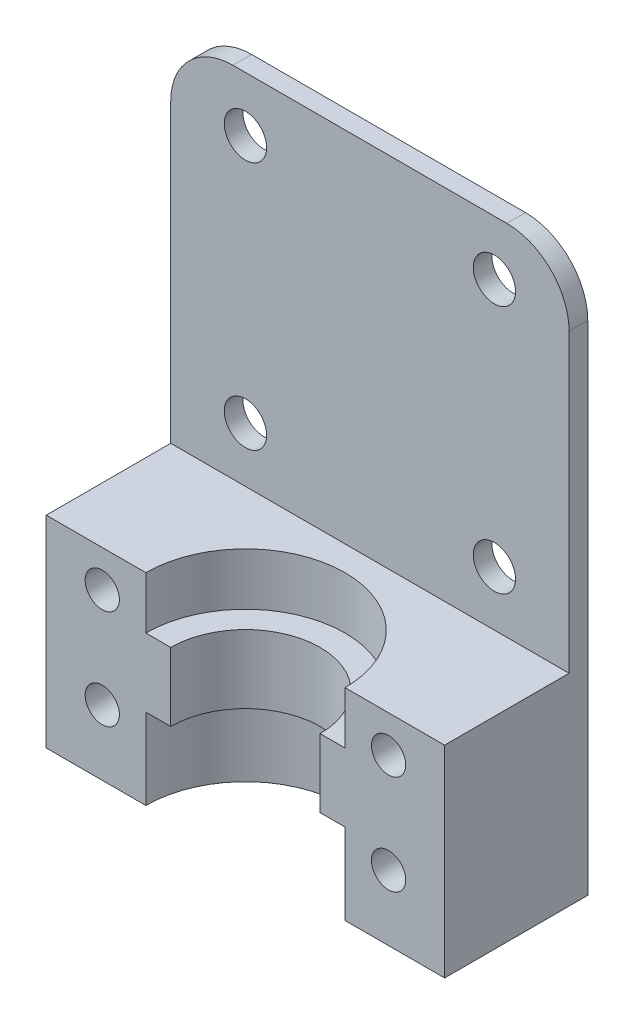
ISO-10303-21;
HEADER;
FILE_DESCRIPTION(('STEP AP214'),'2;1');
FILE_NAME('part.step','',(''),(''),'','','');
FILE_SCHEMA(('AUTOMOTIVE_DESIGN { 1 0 10303 214 1 1 1 1 }'));
ENDSEC;
DATA;
#1=APPLICATION_CONTEXT('core data for automotive mechanical design processes');
#2=APPLICATION_PROTOCOL_DEFINITION('international standard','automotive_design',2000,#1);
#3=PRODUCT_CONTEXT('',#1,'mechanical');
#4=PRODUCT('Part','Part','',(#3));
#5=PRODUCT_RELATED_PRODUCT_CATEGORY('part','',(#4));
#6=PRODUCT_DEFINITION_FORMATION('','',#4);
#7=PRODUCT_DEFINITION_CONTEXT('part definition',#1,'design');
#8=PRODUCT_DEFINITION('design','',#6,#7);
#9=PRODUCT_DEFINITION_SHAPE('','',#8);
#10=(LENGTH_UNIT() NAMED_UNIT(*) SI_UNIT(.MILLI.,.METRE.));
#11=(NAMED_UNIT(*) PLANE_ANGLE_UNIT() SI_UNIT($,.RADIAN.));
#12=(NAMED_UNIT(*) SI_UNIT($,.STERADIAN.) SOLID_ANGLE_UNIT());
#13=UNCERTAINTY_MEASURE_WITH_UNIT(LENGTH_MEASURE(1.E-05),#10,'distance_accuracy_value','');
#14=(GEOMETRIC_REPRESENTATION_CONTEXT(3) GLOBAL_UNCERTAINTY_ASSIGNED_CONTEXT((#13)) GLOBAL_UNIT_ASSIGNED_CONTEXT((#10,
#11,#12)) REPRESENTATION_CONTEXT('',''));
#15=CARTESIAN_POINT('',(0.,0.,0.));
#16=DIRECTION('',(0.,0.,1.));
#17=DIRECTION('',(1.,0.,0.));
#18=AXIS2_PLACEMENT_3D('',#15,#16,#17);
#19=CARTESIAN_POINT('',(16.,0.,-1.5));
#20=DIRECTION('',(0.,0.,1.));
#21=DIRECTION('',(0.,-1.,0.));
#22=AXIS2_PLACEMENT_3D('',#19,#20,#21);
#23=PLANE('',#22);
#24=CARTESIAN_POINT('',(-10.,20.6,-1.5));
#25=DIRECTION('',(0.,0.,1.));
#26=DIRECTION('',(0.,-1.,0.));
#27=AXIS2_PLACEMENT_3D('',#24,#25,#26);
#28=CIRCLE('',#27,1.69999999999999);
#29=CARTESIAN_POINT('',(-10.,18.9,-1.5));
#30=VERTEX_POINT('',#29);
#31=EDGE_CURVE('E474',#30,#30,#28,.T.);
#32=ORIENTED_EDGE('',*,*,#31,.T.);
#33=EDGE_LOOP('',(#32));
#34=FACE_BOUND('',#33,.T.);
#35=CARTESIAN_POINT('',(-10.,40.6,-1.5));
#36=DIRECTION('',(0.,0.,1.));
#37=DIRECTION('',(0.,-1.,0.));
#38=AXIS2_PLACEMENT_3D('',#35,#36,#37);
#39=CIRCLE('',#38,1.69999999999999);
#40=CARTESIAN_POINT('',(-10.,38.9,-1.5));
#41=VERTEX_POINT('',#40);
#42=EDGE_CURVE('E468',#41,#41,#39,.T.);
#43=ORIENTED_EDGE('',*,*,#42,.T.);
#44=EDGE_LOOP('',(#43));
#45=FACE_BOUND('',#44,.T.);
#46=CARTESIAN_POINT('',(10.,40.6,-1.5));
#47=DIRECTION('',(0.,0.,1.));
#48=DIRECTION('',(0.,-1.,0.));
#49=AXIS2_PLACEMENT_3D('',#46,#47,#48);
#50=CIRCLE('',#49,1.69999999999999);
#51=CARTESIAN_POINT('',(10.,38.9,-1.5));
#52=VERTEX_POINT('',#51);
#53=EDGE_CURVE('E462',#52,#52,#50,.T.);
#54=ORIENTED_EDGE('',*,*,#53,.T.);
#55=EDGE_LOOP('',(#54));
#56=FACE_BOUND('',#55,.T.);
#57=CARTESIAN_POINT('',(10.,20.6,-1.5));
#58=DIRECTION('',(0.,0.,1.));
#59=DIRECTION('',(0.,-1.,0.));
#60=AXIS2_PLACEMENT_3D('',#57,#58,#59);
#61=CIRCLE('',#60,1.69999999999999);
#62=CARTESIAN_POINT('',(10.,18.9,-1.5));
#63=VERTEX_POINT('',#62);
#64=EDGE_CURVE('E296',#63,#63,#61,.T.);
#65=ORIENTED_EDGE('',*,*,#64,.T.);
#66=EDGE_LOOP('',(#65));
#67=FACE_BOUND('',#66,.T.);
#68=CARTESIAN_POINT('',(11.5,5.25,-1.5));
#69=DIRECTION('',(0.,0.,1.));
#70=DIRECTION('',(0.,-1.,0.));
#71=AXIS2_PLACEMENT_3D('',#68,#69,#70);
#72=CIRCLE('',#71,1.375);
#73=CARTESIAN_POINT('',(11.5,3.875,-1.5));
#74=VERTEX_POINT('',#73);
#75=EDGE_CURVE('E416',#74,#74,#72,.T.);
#76=ORIENTED_EDGE('',*,*,#75,.T.);
#77=EDGE_LOOP('',(#76));
#78=FACE_BOUND('',#77,.T.);
#79=CARTESIAN_POINT('',(-11.5,5.25,-1.5));
#80=DIRECTION('',(0.,0.,1.));
#81=DIRECTION('',(0.,-1.,0.));
#82=AXIS2_PLACEMENT_3D('',#79,#80,#81);
#83=CIRCLE('',#82,1.375);
#84=CARTESIAN_POINT('',(-11.5,3.87500000000001,-1.5));
#85=VERTEX_POINT('',#84);
#86=EDGE_CURVE('E410',#85,#85,#83,.T.);
#87=ORIENTED_EDGE('',*,*,#86,.T.);
#88=EDGE_LOOP('',(#87));
#89=FACE_BOUND('',#88,.T.);
#90=CARTESIAN_POINT('',(11.5,13.25,-1.5));
#91=DIRECTION('',(0.,0.,1.));
#92=DIRECTION('',(0.,-1.,0.));
#93=AXIS2_PLACEMENT_3D('',#90,#91,#92);
#94=CIRCLE('',#93,1.375);
#95=CARTESIAN_POINT('',(11.5,11.875,-1.5));
#96=VERTEX_POINT('',#95);
#97=EDGE_CURVE('E404',#96,#96,#94,.T.);
#98=ORIENTED_EDGE('',*,*,#97,.T.);
#99=EDGE_LOOP('',(#98));
#100=FACE_BOUND('',#99,.T.);
#101=CARTESIAN_POINT('',(-11.5,13.25,-1.5));
#102=DIRECTION('',(0.,0.,1.));
#103=DIRECTION('',(0.,-1.,0.));
#104=AXIS2_PLACEMENT_3D('',#101,#102,#103);
#105=CIRCLE('',#104,1.375);
#106=CARTESIAN_POINT('',(-11.5,11.875,-1.5));
#107=VERTEX_POINT('',#106);
#108=EDGE_CURVE('E386',#107,#107,#105,.T.);
#109=ORIENTED_EDGE('',*,*,#108,.T.);
#110=EDGE_LOOP('',(#109));
#111=FACE_BOUND('',#110,.T.);
#112=DIRECTION('',(0.,1.,0.));
#113=VECTOR('',#112,1.);
#114=CARTESIAN_POINT('',(-16.,0.,-1.5));
#115=LINE('',#114,#113);
#116=CARTESIAN_POINT('',(-16.,0.,-1.5));
#117=VERTEX_POINT('',#116);
#118=CARTESIAN_POINT('',(-16.,40.,-1.5));
#119=VERTEX_POINT('',#118);
#120=EDGE_CURVE('E325',#117,#119,#115,.T.);
#121=ORIENTED_EDGE('',*,*,#120,.T.);
#122=CARTESIAN_POINT('',(-11.,40.,-1.5));
#123=DIRECTION('',(0.,0.,1.));
#124=DIRECTION('',(0.,-1.,0.));
#125=AXIS2_PLACEMENT_3D('',#122,#123,#124);
#126=CIRCLE('',#125,5.);
#127=CARTESIAN_POINT('',(-11.,45.,-1.5));
#128=VERTEX_POINT('',#127);
#129=EDGE_CURVE('E305',#119,#128,#126,.F.);
#130=ORIENTED_EDGE('',*,*,#129,.T.);
#131=DIRECTION('',(-1.,0.,0.));
#132=VECTOR('',#131,1.);
#133=CARTESIAN_POINT('',(16.,45.,-1.5));
#134=LINE('',#133,#132);
#135=CARTESIAN_POINT('',(11.,45.,-1.5));
#136=VERTEX_POINT('',#135);
#137=EDGE_CURVE('E329',#136,#128,#134,.T.);
#138=ORIENTED_EDGE('',*,*,#137,.F.);
#139=CARTESIAN_POINT('',(11.,40.,-1.5));
#140=DIRECTION('',(0.,0.,1.));
#141=DIRECTION('',(0.,-1.,0.));
#142=AXIS2_PLACEMENT_3D('',#139,#140,#141);
#143=CIRCLE('',#142,5.);
#144=CARTESIAN_POINT('',(16.,40.,-1.5));
#145=VERTEX_POINT('',#144);
#146=EDGE_CURVE('E303',#136,#145,#143,.F.);
#147=ORIENTED_EDGE('',*,*,#146,.T.);
#148=DIRECTION('',(0.,1.,0.));
#149=VECTOR('',#148,1.);
#150=CARTESIAN_POINT('',(16.,0.,-1.5));
#151=LINE('',#150,#149);
#152=CARTESIAN_POINT('',(16.,0.,-1.5));
#153=VERTEX_POINT('',#152);
#154=EDGE_CURVE('E346',#153,#145,#151,.T.);
#155=ORIENTED_EDGE('',*,*,#154,.F.);
#156=DIRECTION('',(-1.,0.,0.));
#157=VECTOR('',#156,1.);
#158=CARTESIAN_POINT('',(16.,0.,-1.5));
#159=LINE('',#158,#157);
#160=CARTESIAN_POINT('',(8.58210678118655,0.,-1.5));
#161=VERTEX_POINT('',#160);
#162=EDGE_CURVE('E200',#153,#161,#159,.T.);
#163=ORIENTED_EDGE('',*,*,#162,.T.);
#164=DIRECTION('',(0.,-1.,0.));
#165=VECTOR('',#164,1.);
#166=CARTESIAN_POINT('',(8.58210678118655,0.,-1.5));
#167=LINE('',#166,#165);
#168=CARTESIAN_POINT('',(8.58210678118655,5.,-1.5));
#169=VERTEX_POINT('',#168);
#170=EDGE_CURVE('E265',#161,#169,#167,.F.);
#171=ORIENTED_EDGE('',*,*,#170,.T.);
#172=DIRECTION('',(-1.,0.,0.));
#173=VECTOR('',#172,1.);
#174=CARTESIAN_POINT('',(7.375,5.,-1.5));
#175=LINE('',#174,#173);
#176=CARTESIAN_POINT('',(-8.58210678118654,5.,-1.5));
#177=VERTEX_POINT('',#176);
#178=EDGE_CURVE('E377',#169,#177,#175,.T.);
#179=ORIENTED_EDGE('',*,*,#178,.T.);
#180=DIRECTION('',(0.,-1.,0.));
#181=VECTOR('',#180,1.);
#182=CARTESIAN_POINT('',(-8.58210678118654,0.,-1.5));
#183=LINE('',#182,#181);
#184=CARTESIAN_POINT('',(-8.58210678118654,0.,-1.5));
#185=VERTEX_POINT('',#184);
#186=EDGE_CURVE('E262',#177,#185,#183,.T.);
#187=ORIENTED_EDGE('',*,*,#186,.T.);
#188=EDGE_CURVE('E332',#185,#117,#159,.T.);
#189=ORIENTED_EDGE('',*,*,#188,.T.);
#190=EDGE_LOOP('',(#121,#130,#138,#147,#155,#163,#171,#179,#187,#189));
#191=FACE_BOUND('',#190,.T.);
#192=ADVANCED_FACE('F38',(#34,#45,#56,#67,#78,#89,#100,#111,#191),#23,.F.);
#193=CARTESIAN_POINT('',(-16.,16.2,10.));
#194=DIRECTION('',(0.,0.,-1.));
#195=DIRECTION('',(-1.,0.,0.));
#196=AXIS2_PLACEMENT_3D('',#193,#194,#195);
#197=PLANE('',#196);
#198=CARTESIAN_POINT('',(11.5,13.25,10.));
#199=DIRECTION('',(0.,0.,1.));
#200=DIRECTION('',(1.,0.,0.));
#201=AXIS2_PLACEMENT_3D('',#198,#199,#200);
#202=CIRCLE('',#201,1.375);
#203=CARTESIAN_POINT('',(12.875,13.25,10.));
#204=VERTEX_POINT('',#203);
#205=EDGE_CURVE('E401',#204,#204,#202,.T.);
#206=ORIENTED_EDGE('',*,*,#205,.F.);
#207=EDGE_LOOP('',(#206));
#208=FACE_BOUND('',#207,.T.);
#209=CARTESIAN_POINT('',(11.5,5.25,10.));
#210=DIRECTION('',(0.,0.,1.));
#211=DIRECTION('',(1.,0.,0.));
#212=AXIS2_PLACEMENT_3D('',#209,#210,#211);
#213=CIRCLE('',#212,1.375);
#214=CARTESIAN_POINT('',(12.875,5.25,10.));
#215=VERTEX_POINT('',#214);
#216=EDGE_CURVE('E413',#215,#215,#213,.T.);
#217=ORIENTED_EDGE('',*,*,#216,.F.);
#218=EDGE_LOOP('',(#217));
#219=FACE_BOUND('',#218,.T.);
#220=DIRECTION('',(1.,0.,0.));
#221=VECTOR('',#220,1.);
#222=CARTESIAN_POINT('',(-16.,16.2,10.));
#223=LINE('',#222,#221);
#224=CARTESIAN_POINT('',(8.,16.2,10.));
#225=VERTEX_POINT('',#224);
#226=CARTESIAN_POINT('',(16.,16.2,10.));
#227=VERTEX_POINT('',#226);
#228=EDGE_CURVE('E218',#225,#227,#223,.T.);
#229=ORIENTED_EDGE('',*,*,#228,.F.);
#230=DIRECTION('',(0.,-1.,0.));
#231=VECTOR('',#230,1.);
#232=CARTESIAN_POINT('',(8.,0.,10.));
#233=LINE('',#232,#231);
#234=CARTESIAN_POINT('',(8.,12.,10.));
#235=VERTEX_POINT('',#234);
#236=EDGE_CURVE('E195',#225,#235,#233,.T.);
#237=ORIENTED_EDGE('',*,*,#236,.T.);
#238=DIRECTION('',(-1.,0.,0.));
#239=VECTOR('',#238,1.);
#240=CARTESIAN_POINT('',(-16.,12.,10.));
#241=LINE('',#240,#239);
#242=CARTESIAN_POINT('',(6.,12.,10.));
#243=VERTEX_POINT('',#242);
#244=EDGE_CURVE('E251',#235,#243,#241,.T.);
#245=ORIENTED_EDGE('',*,*,#244,.T.);
#246=DIRECTION('',(0.,-1.,0.));
#247=VECTOR('',#246,1.);
#248=CARTESIAN_POINT('',(6.,0.,10.));
#249=LINE('',#248,#247);
#250=CARTESIAN_POINT('',(6.,6.5,10.));
#251=VERTEX_POINT('',#250);
#252=EDGE_CURVE('E254',#243,#251,#249,.T.);
#253=ORIENTED_EDGE('',*,*,#252,.T.);
#254=DIRECTION('',(1.,0.,0.));
#255=VECTOR('',#254,1.);
#256=CARTESIAN_POINT('',(-16.,6.5,10.));
#257=LINE('',#256,#255);
#258=CARTESIAN_POINT('',(8.,6.5,10.));
#259=VERTEX_POINT('',#258);
#260=EDGE_CURVE('E247',#251,#259,#257,.T.);
#261=ORIENTED_EDGE('',*,*,#260,.T.);
#262=DIRECTION('',(0.,-1.,0.));
#263=VECTOR('',#262,1.);
#264=CARTESIAN_POINT('',(8.,0.,10.));
#265=LINE('',#264,#263);
#266=CARTESIAN_POINT('',(8.,0.,10.));
#267=VERTEX_POINT('',#266);
#268=EDGE_CURVE('E250',#259,#267,#265,.T.);
#269=ORIENTED_EDGE('',*,*,#268,.T.);
#270=DIRECTION('',(1.,0.,0.));
#271=VECTOR('',#270,1.);
#272=CARTESIAN_POINT('',(-16.,0.,10.));
#273=LINE('',#272,#271);
#274=CARTESIAN_POINT('',(16.,0.,10.));
#275=VERTEX_POINT('',#274);
#276=EDGE_CURVE('E359',#267,#275,#273,.T.);
#277=ORIENTED_EDGE('',*,*,#276,.T.);
#278=DIRECTION('',(0.,-1.,0.));
#279=VECTOR('',#278,1.);
#280=CARTESIAN_POINT('',(16.,16.2,10.));
#281=LINE('',#280,#279);
#282=EDGE_CURVE('E232',#227,#275,#281,.T.);
#283=ORIENTED_EDGE('',*,*,#282,.F.);
#284=EDGE_LOOP('',(#229,#237,#245,#253,#261,#269,#277,#283));
#285=FACE_BOUND('',#284,.T.);
#286=ADVANCED_FACE('F357',(#208,#219,#285),#197,.F.);
#287=CARTESIAN_POINT('',(16.,0.,0.));
#288=DIRECTION('',(0.,1.,0.));
#289=DIRECTION('',(0.,0.,1.));
#290=AXIS2_PLACEMENT_3D('',#287,#288,#289);
#291=PLANE('',#290);
#292=DIRECTION('',(1.,0.,0.));
#293=VECTOR('',#292,1.);
#294=CARTESIAN_POINT('',(-9.375,0.,-3.5));
#295=LINE('',#294,#293);
#296=CARTESIAN_POINT('',(-8.16789321881345,0.,-3.5));
#297=VERTEX_POINT('',#296);
#298=CARTESIAN_POINT('',(8.16789321881346,0.,-3.5));
#299=VERTEX_POINT('',#298);
#300=EDGE_CURVE('E395',#297,#299,#295,.T.);
#301=ORIENTED_EDGE('',*,*,#300,.T.);
#302=CARTESIAN_POINT('',(8.16789321881346,0.,-3.));
#303=DIRECTION('',(0.,1.,0.));
#304=DIRECTION('',(0.,0.,1.));
#305=AXIS2_PLACEMENT_3D('',#302,#303,#304);
#306=CIRCLE('',#305,0.5);
#307=CARTESIAN_POINT('',(8.52144660940673,0.,-2.64644660940673));
#308=VERTEX_POINT('',#307);
#309=EDGE_CURVE('E275',#299,#308,#306,.F.);
#310=ORIENTED_EDGE('',*,*,#309,.T.);
#311=DIRECTION('',(-0.707106781186547,0.,0.707106781186548));
#312=VECTOR('',#311,1.);
#313=CARTESIAN_POINT('',(9.375,0.,-3.5));
#314=LINE('',#313,#312);
#315=CARTESIAN_POINT('',(8.22855339059328,0.,-2.35355339059327));
#316=VERTEX_POINT('',#315);
#317=EDGE_CURVE('E397',#308,#316,#314,.T.);
#318=ORIENTED_EDGE('',*,*,#317,.T.);
#319=CARTESIAN_POINT('',(8.58210678118655,0.,-2.));
#320=DIRECTION('',(0.,1.,0.));
#321=DIRECTION('',(0.,0.,1.));
#322=AXIS2_PLACEMENT_3D('',#319,#320,#321);
#323=CIRCLE('',#322,0.5);
#324=EDGE_CURVE('E286',#316,#161,#323,.T.);
#325=ORIENTED_EDGE('',*,*,#324,.T.);
#326=ORIENTED_EDGE('',*,*,#162,.F.);
#327=DIRECTION('',(0.,0.,-1.));
#328=VECTOR('',#327,1.);
#329=CARTESIAN_POINT('',(16.,0.,0.));
#330=LINE('',#329,#328);
#331=EDGE_CURVE('E324',#275,#153,#330,.T.);
#332=ORIENTED_EDGE('',*,*,#331,.F.);
#333=ORIENTED_EDGE('',*,*,#276,.F.);
#334=CARTESIAN_POINT('',(0.,0.,10.));
#335=DIRECTION('',(0.,-1.,0.));
#336=DIRECTION('',(0.,0.,-1.));
#337=AXIS2_PLACEMENT_3D('',#334,#335,#336);
#338=CIRCLE('',#337,8.);
#339=CARTESIAN_POINT('',(-8.,0.,10.));
#340=VERTEX_POINT('',#339);
#341=EDGE_CURVE('E419',#340,#267,#338,.T.);
#342=ORIENTED_EDGE('',*,*,#341,.F.);
#343=CARTESIAN_POINT('',(-16.,0.,10.));
#344=VERTEX_POINT('',#343);
#345=EDGE_CURVE('E227',#344,#340,#273,.T.);
#346=ORIENTED_EDGE('',*,*,#345,.F.);
#347=DIRECTION('',(0.,0.,-1.));
#348=VECTOR('',#347,1.);
#349=CARTESIAN_POINT('',(-16.,0.,0.));
#350=LINE('',#349,#348);
#351=EDGE_CURVE('E341',#344,#117,#350,.T.);
#352=ORIENTED_EDGE('',*,*,#351,.T.);
#353=ORIENTED_EDGE('',*,*,#188,.F.);
#354=CARTESIAN_POINT('',(-8.58210678118654,0.,-2.));
#355=DIRECTION('',(0.,1.,0.));
#356=DIRECTION('',(0.,0.,1.));
#357=AXIS2_PLACEMENT_3D('',#354,#355,#356);
#358=CIRCLE('',#357,0.5);
#359=CARTESIAN_POINT('',(-8.22855339059327,0.,-2.35355339059327));
#360=VERTEX_POINT('',#359);
#361=EDGE_CURVE('E290',#185,#360,#358,.T.);
#362=ORIENTED_EDGE('',*,*,#361,.T.);
#363=DIRECTION('',(-0.707106781186548,0.,-0.707106781186547));
#364=VECTOR('',#363,1.);
#365=CARTESIAN_POINT('',(-7.375,0.,-1.5));
#366=LINE('',#365,#364);
#367=CARTESIAN_POINT('',(-8.52144660940673,0.,-2.64644660940673));
#368=VERTEX_POINT('',#367);
#369=EDGE_CURVE('E299',#360,#368,#366,.T.);
#370=ORIENTED_EDGE('',*,*,#369,.T.);
#371=CARTESIAN_POINT('',(-8.16789321881345,0.,-3.));
#372=DIRECTION('',(0.,1.,0.));
#373=DIRECTION('',(0.,0.,1.));
#374=AXIS2_PLACEMENT_3D('',#371,#372,#373);
#375=CIRCLE('',#374,0.5);
#376=EDGE_CURVE('E273',#368,#297,#375,.F.);
#377=ORIENTED_EDGE('',*,*,#376,.T.);
#378=EDGE_LOOP('',(#301,#310,#318,#325,#326,#332,#333,#342,#346,#352,#353,#362,#370,#377));
#379=FACE_BOUND('',#378,.T.);
#380=ADVANCED_FACE('F364',(#379),#291,.F.);
#381=CARTESIAN_POINT('',(16.,45.,0.));
#382=DIRECTION('',(0.,1.,0.));
#383=DIRECTION('',(0.,0.,1.));
#384=AXIS2_PLACEMENT_3D('',#381,#382,#383);
#385=PLANE('',#384);
#386=ORIENTED_EDGE('',*,*,#137,.T.);
#387=DIRECTION('',(0.,0.,-1.));
#388=VECTOR('',#387,1.);
#389=CARTESIAN_POINT('',(-11.,45.,0.));
#390=LINE('',#389,#388);
#391=CARTESIAN_POINT('',(-11.,45.,0.));
#392=VERTEX_POINT('',#391);
#393=EDGE_CURVE('E59',#128,#392,#390,.F.);
#394=ORIENTED_EDGE('',*,*,#393,.T.);
#395=DIRECTION('',(-1.,0.,0.));
#396=VECTOR('',#395,1.);
#397=CARTESIAN_POINT('',(16.,45.,0.));
#398=LINE('',#397,#396);
#399=CARTESIAN_POINT('',(11.,45.,0.));
#400=VERTEX_POINT('',#399);
#401=EDGE_CURVE('E317',#400,#392,#398,.T.);
#402=ORIENTED_EDGE('',*,*,#401,.F.);
#403=DIRECTION('',(0.,0.,-1.));
#404=VECTOR('',#403,1.);
#405=CARTESIAN_POINT('',(11.,45.,0.));
#406=LINE('',#405,#404);
#407=EDGE_CURVE('E307',#400,#136,#406,.T.);
#408=ORIENTED_EDGE('',*,*,#407,.T.);
#409=EDGE_LOOP('',(#386,#394,#402,#408));
#410=FACE_BOUND('',#409,.T.);
#411=ADVANCED_FACE('F330',(#410),#385,.T.);
#412=CARTESIAN_POINT('',(16.,0.,0.));
#413=DIRECTION('',(0.,0.,1.));
#414=DIRECTION('',(1.,0.,0.));
#415=AXIS2_PLACEMENT_3D('',#412,#413,#414);
#416=PLANE('',#415);
#417=CARTESIAN_POINT('',(-10.,20.6,0.));
#418=DIRECTION('',(0.,0.,1.));
#419=DIRECTION('',(1.,0.,0.));
#420=AXIS2_PLACEMENT_3D('',#417,#418,#419);
#421=CIRCLE('',#420,1.69999999999999);
#422=CARTESIAN_POINT('',(-8.30000000000001,20.6,0.));
#423=VERTEX_POINT('',#422);
#424=EDGE_CURVE('E477',#423,#423,#421,.T.);
#425=ORIENTED_EDGE('',*,*,#424,.F.);
#426=EDGE_LOOP('',(#425));
#427=FACE_BOUND('',#426,.T.);
#428=CARTESIAN_POINT('',(-10.,40.6,0.));
#429=DIRECTION('',(0.,0.,1.));
#430=DIRECTION('',(1.,0.,0.));
#431=AXIS2_PLACEMENT_3D('',#428,#429,#430);
#432=CIRCLE('',#431,1.69999999999999);
#433=CARTESIAN_POINT('',(-8.30000000000001,40.6,0.));
#434=VERTEX_POINT('',#433);
#435=EDGE_CURVE('E471',#434,#434,#432,.T.);
#436=ORIENTED_EDGE('',*,*,#435,.F.);
#437=EDGE_LOOP('',(#436));
#438=FACE_BOUND('',#437,.T.);
#439=CARTESIAN_POINT('',(10.,40.6,0.));
#440=DIRECTION('',(0.,0.,1.));
#441=DIRECTION('',(1.,0.,0.));
#442=AXIS2_PLACEMENT_3D('',#439,#440,#441);
#443=CIRCLE('',#442,1.69999999999999);
#444=CARTESIAN_POINT('',(11.7,40.6,0.));
#445=VERTEX_POINT('',#444);
#446=EDGE_CURVE('E465',#445,#445,#443,.T.);
#447=ORIENTED_EDGE('',*,*,#446,.F.);
#448=EDGE_LOOP('',(#447));
#449=FACE_BOUND('',#448,.T.);
#450=CARTESIAN_POINT('',(10.,20.6,0.));
#451=DIRECTION('',(0.,0.,1.));
#452=DIRECTION('',(1.,0.,0.));
#453=AXIS2_PLACEMENT_3D('',#450,#451,#452);
#454=CIRCLE('',#453,1.69999999999999);
#455=CARTESIAN_POINT('',(11.7,20.6,0.));
#456=VERTEX_POINT('',#455);
#457=EDGE_CURVE('E300',#456,#456,#454,.T.);
#458=ORIENTED_EDGE('',*,*,#457,.F.);
#459=EDGE_LOOP('',(#458));
#460=FACE_BOUND('',#459,.T.);
#461=ORIENTED_EDGE('',*,*,#401,.T.);
#462=CARTESIAN_POINT('',(-11.,40.,0.));
#463=DIRECTION('',(0.,0.,1.));
#464=DIRECTION('',(1.,0.,0.));
#465=AXIS2_PLACEMENT_3D('',#462,#463,#464);
#466=CIRCLE('',#465,5.);
#467=CARTESIAN_POINT('',(-16.,40.,0.));
#468=VERTEX_POINT('',#467);
#469=EDGE_CURVE('E46',#392,#468,#466,.T.);
#470=ORIENTED_EDGE('',*,*,#469,.T.);
#471=DIRECTION('',(0.,1.,0.));
#472=VECTOR('',#471,1.);
#473=CARTESIAN_POINT('',(-16.,0.,0.));
#474=LINE('',#473,#472);
#475=CARTESIAN_POINT('',(-16.,16.2,0.));
#476=VERTEX_POINT('',#475);
#477=EDGE_CURVE('E316',#476,#468,#474,.T.);
#478=ORIENTED_EDGE('',*,*,#477,.F.);
#479=DIRECTION('',(-1.,0.,0.));
#480=VECTOR('',#479,1.);
#481=CARTESIAN_POINT('',(-16.,16.2,0.));
#482=LINE('',#481,#480);
#483=CARTESIAN_POINT('',(16.,16.2,0.));
#484=VERTEX_POINT('',#483);
#485=EDGE_CURVE('E221',#484,#476,#482,.T.);
#486=ORIENTED_EDGE('',*,*,#485,.F.);
#487=DIRECTION('',(0.,1.,0.));
#488=VECTOR('',#487,1.);
#489=CARTESIAN_POINT('',(16.,0.,0.));
#490=LINE('',#489,#488);
#491=CARTESIAN_POINT('',(16.,40.,0.));
#492=VERTEX_POINT('',#491);
#493=EDGE_CURVE('E233',#484,#492,#490,.T.);
#494=ORIENTED_EDGE('',*,*,#493,.T.);
#495=CARTESIAN_POINT('',(11.,40.,0.));
#496=DIRECTION('',(0.,0.,1.));
#497=DIRECTION('',(1.,0.,0.));
#498=AXIS2_PLACEMENT_3D('',#495,#496,#497);
#499=CIRCLE('',#498,5.);
#500=EDGE_CURVE('E311',#492,#400,#499,.T.);
#501=ORIENTED_EDGE('',*,*,#500,.T.);
#502=EDGE_LOOP('',(#461,#470,#478,#486,#494,#501));
#503=FACE_BOUND('',#502,.T.);
#504=ADVANCED_FACE('F315',(#427,#438,#449,#460,#503),#416,.T.);
#505=CARTESIAN_POINT('',(16.,0.,0.));
#506=DIRECTION('',(1.,0.,0.));
#507=DIRECTION('',(0.,0.,-1.));
#508=AXIS2_PLACEMENT_3D('',#505,#506,#507);
#509=PLANE('',#508);
#510=ORIENTED_EDGE('',*,*,#154,.T.);
#511=DIRECTION('',(0.,0.,-1.));
#512=VECTOR('',#511,1.);
#513=CARTESIAN_POINT('',(16.,40.,0.));
#514=LINE('',#513,#512);
#515=EDGE_CURVE('E11',#145,#492,#514,.F.);
#516=ORIENTED_EDGE('',*,*,#515,.T.);
#517=ORIENTED_EDGE('',*,*,#493,.F.);
#518=DIRECTION('',(0.,0.,-1.));
#519=VECTOR('',#518,1.);
#520=CARTESIAN_POINT('',(16.,16.2,10.));
#521=LINE('',#520,#519);
#522=EDGE_CURVE('E217',#227,#484,#521,.T.);
#523=ORIENTED_EDGE('',*,*,#522,.F.);
#524=ORIENTED_EDGE('',*,*,#282,.T.);
#525=ORIENTED_EDGE('',*,*,#331,.T.);
#526=EDGE_LOOP('',(#510,#516,#517,#523,#524,#525));
#527=FACE_BOUND('',#526,.T.);
#528=ADVANCED_FACE('F353',(#527),#509,.T.);
#529=CARTESIAN_POINT('',(-16.,0.,0.));
#530=DIRECTION('',(1.,0.,0.));
#531=DIRECTION('',(0.,0.,-1.));
#532=AXIS2_PLACEMENT_3D('',#529,#530,#531);
#533=PLANE('',#532);
#534=ORIENTED_EDGE('',*,*,#477,.T.);
#535=DIRECTION('',(0.,0.,-1.));
#536=VECTOR('',#535,1.);
#537=CARTESIAN_POINT('',(-16.,40.,-1.5));
#538=LINE('',#537,#536);
#539=EDGE_CURVE('E295',#468,#119,#538,.T.);
#540=ORIENTED_EDGE('',*,*,#539,.T.);
#541=ORIENTED_EDGE('',*,*,#120,.F.);
#542=ORIENTED_EDGE('',*,*,#351,.F.);
#543=DIRECTION('',(0.,-1.,0.));
#544=VECTOR('',#543,1.);
#545=CARTESIAN_POINT('',(-16.,16.2,10.));
#546=LINE('',#545,#544);
#547=CARTESIAN_POINT('',(-16.,16.2,10.));
#548=VERTEX_POINT('',#547);
#549=EDGE_CURVE('E343',#548,#344,#546,.T.);
#550=ORIENTED_EDGE('',*,*,#549,.F.);
#551=DIRECTION('',(0.,0.,1.));
#552=VECTOR('',#551,1.);
#553=CARTESIAN_POINT('',(-16.,16.2,10.));
#554=LINE('',#553,#552);
#555=EDGE_CURVE('E215',#476,#548,#554,.T.);
#556=ORIENTED_EDGE('',*,*,#555,.F.);
#557=EDGE_LOOP('',(#534,#540,#541,#542,#550,#556));
#558=FACE_BOUND('',#557,.T.);
#559=ADVANCED_FACE('F321',(#558),#533,.F.);
#560=CARTESIAN_POINT('',(-11.5,13.25,10.));
#561=DIRECTION('',(0.,0.,1.));
#562=DIRECTION('',(1.,0.,0.));
#563=AXIS2_PLACEMENT_3D('',#560,#561,#562);
#564=CIRCLE('',#563,1.375);
#565=CARTESIAN_POINT('',(-10.125,13.25,10.));
#566=VERTEX_POINT('',#565);
#567=EDGE_CURVE('E382',#566,#566,#564,.T.);
#568=ORIENTED_EDGE('',*,*,#567,.F.);
#569=EDGE_LOOP('',(#568));
#570=FACE_BOUND('',#569,.T.);
#571=CARTESIAN_POINT('',(-11.5,5.25,10.));
#572=DIRECTION('',(0.,0.,1.));
#573=DIRECTION('',(1.,0.,0.));
#574=AXIS2_PLACEMENT_3D('',#571,#572,#573);
#575=CIRCLE('',#574,1.375);
#576=CARTESIAN_POINT('',(-10.125,5.25,10.));
#577=VERTEX_POINT('',#576);
#578=EDGE_CURVE('E407',#577,#577,#575,.T.);
#579=ORIENTED_EDGE('',*,*,#578,.F.);
#580=EDGE_LOOP('',(#579));
#581=FACE_BOUND('',#580,.T.);
#582=CARTESIAN_POINT('',(-6.,12.,10.));
#583=VERTEX_POINT('',#582);
#584=CARTESIAN_POINT('',(-8.,12.,10.));
#585=VERTEX_POINT('',#584);
#586=EDGE_CURVE('E209',#583,#585,#241,.T.);
#587=ORIENTED_EDGE('',*,*,#586,.T.);
#588=DIRECTION('',(0.,-1.,0.));
#589=VECTOR('',#588,1.);
#590=CARTESIAN_POINT('',(-8.,0.,10.));
#591=LINE('',#590,#589);
#592=CARTESIAN_POINT('',(-8.,16.2,10.));
#593=VERTEX_POINT('',#592);
#594=EDGE_CURVE('E192',#585,#593,#591,.F.);
#595=ORIENTED_EDGE('',*,*,#594,.T.);
#596=EDGE_CURVE('E206',#548,#593,#223,.T.);
#597=ORIENTED_EDGE('',*,*,#596,.F.);
#598=ORIENTED_EDGE('',*,*,#549,.T.);
#599=ORIENTED_EDGE('',*,*,#345,.T.);
#600=DIRECTION('',(0.,-1.,0.));
#601=VECTOR('',#600,1.);
#602=CARTESIAN_POINT('',(-8.,0.,10.));
#603=LINE('',#602,#601);
#604=CARTESIAN_POINT('',(-8.,6.5,10.));
#605=VERTEX_POINT('',#604);
#606=EDGE_CURVE('E199',#340,#605,#603,.F.);
#607=ORIENTED_EDGE('',*,*,#606,.T.);
#608=CARTESIAN_POINT('',(-6.,6.5,10.));
#609=VERTEX_POINT('',#608);
#610=EDGE_CURVE('E243',#605,#609,#257,.T.);
#611=ORIENTED_EDGE('',*,*,#610,.T.);
#612=DIRECTION('',(0.,-1.,0.));
#613=VECTOR('',#612,1.);
#614=CARTESIAN_POINT('',(-6.,0.,10.));
#615=LINE('',#614,#613);
#616=EDGE_CURVE('E246',#609,#583,#615,.F.);
#617=ORIENTED_EDGE('',*,*,#616,.T.);
#618=EDGE_LOOP('',(#587,#595,#597,#598,#599,#607,#611,#617));
#619=FACE_BOUND('',#618,.T.);
#620=ADVANCED_FACE('F204',(#570,#581,#619),#197,.F.);
#621=CARTESIAN_POINT('',(0.,16.2,0.));
#622=DIRECTION('',(0.,-1.,0.));
#623=DIRECTION('',(0.,0.,-1.));
#624=AXIS2_PLACEMENT_3D('',#621,#622,#623);
#625=PLANE('',#624);
#626=ORIENTED_EDGE('',*,*,#596,.T.);
#627=CARTESIAN_POINT('',(0.,16.2,10.));
#628=DIRECTION('',(0.,-1.,0.));
#629=DIRECTION('',(0.,0.,-1.));
#630=AXIS2_PLACEMENT_3D('',#627,#628,#629);
#631=CIRCLE('',#630,8.);
#632=EDGE_CURVE('E188',#593,#225,#631,.T.);
#633=ORIENTED_EDGE('',*,*,#632,.T.);
#634=ORIENTED_EDGE('',*,*,#228,.T.);
#635=ORIENTED_EDGE('',*,*,#522,.T.);
#636=ORIENTED_EDGE('',*,*,#485,.T.);
#637=ORIENTED_EDGE('',*,*,#555,.T.);
#638=EDGE_LOOP('',(#626,#633,#634,#635,#636,#637));
#639=FACE_BOUND('',#638,.T.);
#640=ADVANCED_FACE('F212',(#639),#625,.F.);
#641=CARTESIAN_POINT('',(0.,12.,2.));
#642=DIRECTION('',(0.,-1.,0.));
#643=DIRECTION('',(0.,0.,-1.));
#644=AXIS2_PLACEMENT_3D('',#641,#642,#643);
#645=PLANE('',#644);
#646=CARTESIAN_POINT('',(0.,12.,10.));
#647=DIRECTION('',(0.,-1.,0.));
#648=DIRECTION('',(0.,0.,-1.));
#649=AXIS2_PLACEMENT_3D('',#646,#647,#648);
#650=CIRCLE('',#649,8.);
#651=EDGE_CURVE('E210',#585,#235,#650,.T.);
#652=ORIENTED_EDGE('',*,*,#651,.F.);
#653=ORIENTED_EDGE('',*,*,#586,.F.);
#654=CARTESIAN_POINT('',(0.,12.,10.));
#655=DIRECTION('',(0.,-1.,0.));
#656=DIRECTION('',(0.,0.,-1.));
#657=AXIS2_PLACEMENT_3D('',#654,#655,#656);
#658=CIRCLE('',#657,6.);
#659=EDGE_CURVE('E427',#583,#243,#658,.T.);
#660=ORIENTED_EDGE('',*,*,#659,.T.);
#661=ORIENTED_EDGE('',*,*,#244,.F.);
#662=EDGE_LOOP('',(#652,#653,#660,#661));
#663=FACE_BOUND('',#662,.T.);
#664=ADVANCED_FACE('F432',(#663),#645,.F.);
#665=CARTESIAN_POINT('',(0.,0.,10.));
#666=DIRECTION('',(0.,-1.,0.));
#667=DIRECTION('',(0.,0.,-1.));
#668=AXIS2_PLACEMENT_3D('',#665,#666,#667);
#669=CYLINDRICAL_SURFACE('',#668,6.);
#670=ORIENTED_EDGE('',*,*,#659,.F.);
#671=ORIENTED_EDGE('',*,*,#616,.F.);
#672=CARTESIAN_POINT('',(0.,6.5,10.));
#673=DIRECTION('',(0.,-1.,0.));
#674=DIRECTION('',(0.,0.,-1.));
#675=AXIS2_PLACEMENT_3D('',#672,#673,#674);
#676=CIRCLE('',#675,6.);
#677=EDGE_CURVE('E424',#609,#251,#676,.T.);
#678=ORIENTED_EDGE('',*,*,#677,.T.);
#679=ORIENTED_EDGE('',*,*,#252,.F.);
#680=EDGE_LOOP('',(#670,#671,#678,#679));
#681=FACE_BOUND('',#680,.T.);
#682=ADVANCED_FACE('F435',(#681),#669,.F.);
#683=CARTESIAN_POINT('',(0.,6.5,4.));
#684=DIRECTION('',(0.,1.,0.));
#685=DIRECTION('',(0.,0.,1.));
#686=AXIS2_PLACEMENT_3D('',#683,#684,#685);
#687=PLANE('',#686);
#688=CARTESIAN_POINT('',(0.,6.5,10.));
#689=DIRECTION('',(0.,-1.,0.));
#690=DIRECTION('',(0.,0.,-1.));
#691=AXIS2_PLACEMENT_3D('',#688,#689,#690);
#692=CIRCLE('',#691,8.);
#693=EDGE_CURVE('E421',#605,#259,#692,.T.);
#694=ORIENTED_EDGE('',*,*,#693,.T.);
#695=ORIENTED_EDGE('',*,*,#260,.F.);
#696=ORIENTED_EDGE('',*,*,#677,.F.);
#697=ORIENTED_EDGE('',*,*,#610,.F.);
#698=EDGE_LOOP('',(#694,#695,#696,#697));
#699=FACE_BOUND('',#698,.T.);
#700=ADVANCED_FACE('F440',(#699),#687,.F.);
#701=CARTESIAN_POINT('',(0.,0.,10.));
#702=DIRECTION('',(0.,-1.,0.));
#703=DIRECTION('',(0.,0.,-1.));
#704=AXIS2_PLACEMENT_3D('',#701,#702,#703);
#705=CYLINDRICAL_SURFACE('',#704,8.);
#706=ORIENTED_EDGE('',*,*,#693,.F.);
#707=ORIENTED_EDGE('',*,*,#606,.F.);
#708=ORIENTED_EDGE('',*,*,#341,.T.);
#709=ORIENTED_EDGE('',*,*,#268,.F.);
#710=EDGE_LOOP('',(#706,#707,#708,#709));
#711=FACE_BOUND('',#710,.T.);
#712=ADVANCED_FACE('F442',(#711),#705,.F.);
#713=CARTESIAN_POINT('',(0.,0.,10.));
#714=DIRECTION('',(0.,-1.,0.));
#715=DIRECTION('',(0.,0.,-1.));
#716=AXIS2_PLACEMENT_3D('',#713,#714,#715);
#717=CYLINDRICAL_SURFACE('',#716,8.);
#718=ORIENTED_EDGE('',*,*,#632,.F.);
#719=ORIENTED_EDGE('',*,*,#594,.F.);
#720=ORIENTED_EDGE('',*,*,#651,.T.);
#721=ORIENTED_EDGE('',*,*,#236,.F.);
#722=EDGE_LOOP('',(#718,#719,#720,#721));
#723=FACE_BOUND('',#722,.T.);
#724=ADVANCED_FACE('F190',(#723),#717,.F.);
#725=CARTESIAN_POINT('',(11.5,5.25,10.));
#726=DIRECTION('',(0.,0.,1.));
#727=DIRECTION('',(1.,0.,0.));
#728=AXIS2_PLACEMENT_3D('',#725,#726,#727);
#729=CYLINDRICAL_SURFACE('',#728,1.375);
#730=ORIENTED_EDGE('',*,*,#216,.T.);
#731=EDGE_LOOP('',(#730));
#732=FACE_BOUND('',#731,.T.);
#733=ORIENTED_EDGE('',*,*,#75,.F.);
#734=EDGE_LOOP('',(#733));
#735=FACE_BOUND('',#734,.T.);
#736=ADVANCED_FACE('F531',(#732,#735),#729,.F.);
#737=CARTESIAN_POINT('',(-11.5,5.25,10.));
#738=DIRECTION('',(0.,0.,1.));
#739=DIRECTION('',(1.,0.,0.));
#740=AXIS2_PLACEMENT_3D('',#737,#738,#739);
#741=CYLINDRICAL_SURFACE('',#740,1.375);
#742=ORIENTED_EDGE('',*,*,#578,.T.);
#743=EDGE_LOOP('',(#742));
#744=FACE_BOUND('',#743,.T.);
#745=ORIENTED_EDGE('',*,*,#86,.F.);
#746=EDGE_LOOP('',(#745));
#747=FACE_BOUND('',#746,.T.);
#748=ADVANCED_FACE('F523',(#744,#747),#741,.F.);
#749=CARTESIAN_POINT('',(11.5,13.25,10.));
#750=DIRECTION('',(0.,0.,1.));
#751=DIRECTION('',(1.,0.,0.));
#752=AXIS2_PLACEMENT_3D('',#749,#750,#751);
#753=CYLINDRICAL_SURFACE('',#752,1.375);
#754=ORIENTED_EDGE('',*,*,#205,.T.);
#755=EDGE_LOOP('',(#754));
#756=FACE_BOUND('',#755,.T.);
#757=ORIENTED_EDGE('',*,*,#97,.F.);
#758=EDGE_LOOP('',(#757));
#759=FACE_BOUND('',#758,.T.);
#760=ADVANCED_FACE('F514',(#756,#759),#753,.F.);
#761=CARTESIAN_POINT('',(-11.5,13.25,10.));
#762=DIRECTION('',(0.,0.,1.));
#763=DIRECTION('',(1.,0.,0.));
#764=AXIS2_PLACEMENT_3D('',#761,#762,#763);
#765=CYLINDRICAL_SURFACE('',#764,1.375);
#766=ORIENTED_EDGE('',*,*,#567,.T.);
#767=EDGE_LOOP('',(#766));
#768=FACE_BOUND('',#767,.T.);
#769=ORIENTED_EDGE('',*,*,#108,.F.);
#770=EDGE_LOOP('',(#769));
#771=FACE_BOUND('',#770,.T.);
#772=ADVANCED_FACE('F512',(#768,#771),#765,.F.);
#773=CARTESIAN_POINT('',(9.375,5.,-3.5));
#774=DIRECTION('',(0.707106781186548,0.,0.707106781186547));
#775=DIRECTION('',(0.707106781186547,0.,-0.707106781186548));
#776=AXIS2_PLACEMENT_3D('',#773,#774,#775);
#777=PLANE('',#776);
#778=DIRECTION('',(-0.707106781186547,0.,0.707106781186548));
#779=VECTOR('',#778,1.);
#780=CARTESIAN_POINT('',(9.375,5.,-3.5));
#781=LINE('',#780,#779);
#782=CARTESIAN_POINT('',(8.52144660940673,5.,-2.64644660940673));
#783=VERTEX_POINT('',#782);
#784=CARTESIAN_POINT('',(8.22855339059328,5.,-2.35355339059327));
#785=VERTEX_POINT('',#784);
#786=EDGE_CURVE('E375',#783,#785,#781,.T.);
#787=ORIENTED_EDGE('',*,*,#786,.T.);
#788=DIRECTION('',(0.,-1.,0.));
#789=VECTOR('',#788,1.);
#790=CARTESIAN_POINT('',(8.22855339059328,5.,-2.35355339059327));
#791=LINE('',#790,#789);
#792=EDGE_CURVE('E259',#785,#316,#791,.T.);
#793=ORIENTED_EDGE('',*,*,#792,.T.);
#794=ORIENTED_EDGE('',*,*,#317,.F.);
#795=DIRECTION('',(0.,-1.,0.));
#796=VECTOR('',#795,1.);
#797=CARTESIAN_POINT('',(8.52144660940673,5.,-2.64644660940673));
#798=LINE('',#797,#796);
#799=EDGE_CURVE('E257',#308,#783,#798,.F.);
#800=ORIENTED_EDGE('',*,*,#799,.T.);
#801=EDGE_LOOP('',(#787,#793,#794,#800));
#802=FACE_BOUND('',#801,.T.);
#803=ADVANCED_FACE('F379',(#802),#777,.T.);
#804=CARTESIAN_POINT('',(-9.375,5.,-3.5));
#805=DIRECTION('',(0.,0.,-1.));
#806=DIRECTION('',(-1.,0.,0.));
#807=AXIS2_PLACEMENT_3D('',#804,#805,#806);
#808=PLANE('',#807);
#809=DIRECTION('',(1.,0.,0.));
#810=VECTOR('',#809,1.);
#811=CARTESIAN_POINT('',(-9.375,5.,-3.5));
#812=LINE('',#811,#810);
#813=CARTESIAN_POINT('',(-8.16789321881345,5.,-3.5));
#814=VERTEX_POINT('',#813);
#815=CARTESIAN_POINT('',(8.16789321881346,5.,-3.5));
#816=VERTEX_POINT('',#815);
#817=EDGE_CURVE('E383',#814,#816,#812,.T.);
#818=ORIENTED_EDGE('',*,*,#817,.T.);
#819=DIRECTION('',(0.,-1.,0.));
#820=VECTOR('',#819,1.);
#821=CARTESIAN_POINT('',(8.16789321881346,5.,-3.5));
#822=LINE('',#821,#820);
#823=EDGE_CURVE('E270',#816,#299,#822,.T.);
#824=ORIENTED_EDGE('',*,*,#823,.T.);
#825=ORIENTED_EDGE('',*,*,#300,.F.);
#826=DIRECTION('',(0.,-1.,0.));
#827=VECTOR('',#826,1.);
#828=CARTESIAN_POINT('',(-8.16789321881345,5.,-3.5));
#829=LINE('',#828,#827);
#830=EDGE_CURVE('E268',#297,#814,#829,.F.);
#831=ORIENTED_EDGE('',*,*,#830,.T.);
#832=EDGE_LOOP('',(#818,#824,#825,#831));
#833=FACE_BOUND('',#832,.T.);
#834=ADVANCED_FACE('F521',(#833),#808,.T.);
#835=CARTESIAN_POINT('',(-7.375,5.,-1.5));
#836=DIRECTION('',(-0.707106781186547,0.,0.707106781186548));
#837=DIRECTION('',(0.707106781186548,0.,0.707106781186547));
#838=AXIS2_PLACEMENT_3D('',#835,#836,#837);
#839=PLANE('',#838);
#840=DIRECTION('',(-0.707106781186548,0.,-0.707106781186547));
#841=VECTOR('',#840,1.);
#842=CARTESIAN_POINT('',(-7.375,5.,-1.5));
#843=LINE('',#842,#841);
#844=CARTESIAN_POINT('',(-8.22855339059327,5.,-2.35355339059327));
#845=VERTEX_POINT('',#844);
#846=CARTESIAN_POINT('',(-8.52144660940673,5.,-2.64644660940673));
#847=VERTEX_POINT('',#846);
#848=EDGE_CURVE('E389',#845,#847,#843,.T.);
#849=ORIENTED_EDGE('',*,*,#848,.T.);
#850=DIRECTION('',(0.,-1.,0.));
#851=VECTOR('',#850,1.);
#852=CARTESIAN_POINT('',(-8.52144660940673,5.,-2.64644660940673));
#853=LINE('',#852,#851);
#854=EDGE_CURVE('E283',#847,#368,#853,.T.);
#855=ORIENTED_EDGE('',*,*,#854,.T.);
#856=ORIENTED_EDGE('',*,*,#369,.F.);
#857=DIRECTION('',(0.,-1.,0.));
#858=VECTOR('',#857,1.);
#859=CARTESIAN_POINT('',(-8.22855339059327,5.,-2.35355339059327));
#860=LINE('',#859,#858);
#861=EDGE_CURVE('E281',#360,#845,#860,.F.);
#862=ORIENTED_EDGE('',*,*,#861,.T.);
#863=EDGE_LOOP('',(#849,#855,#856,#862));
#864=FACE_BOUND('',#863,.T.);
#865=ADVANCED_FACE('F454',(#864),#839,.T.);
#866=CARTESIAN_POINT('',(0.,5.,0.));
#867=DIRECTION('',(0.,-1.,0.));
#868=DIRECTION('',(0.,0.,-1.));
#869=AXIS2_PLACEMENT_3D('',#866,#867,#868);
#870=PLANE('',#869);
#871=ORIENTED_EDGE('',*,*,#786,.F.);
#872=CARTESIAN_POINT('',(8.16789321881346,5.,-3.));
#873=DIRECTION('',(0.,-1.,0.));
#874=DIRECTION('',(0.,0.,-1.));
#875=AXIS2_PLACEMENT_3D('',#872,#873,#874);
#876=CIRCLE('',#875,0.5);
#877=EDGE_CURVE('E279',#783,#816,#876,.F.);
#878=ORIENTED_EDGE('',*,*,#877,.T.);
#879=ORIENTED_EDGE('',*,*,#817,.F.);
#880=CARTESIAN_POINT('',(-8.16789321881345,5.,-3.));
#881=DIRECTION('',(0.,-1.,0.));
#882=DIRECTION('',(0.,0.,-1.));
#883=AXIS2_PLACEMENT_3D('',#880,#881,#882);
#884=CIRCLE('',#883,0.5);
#885=EDGE_CURVE('E277',#814,#847,#884,.F.);
#886=ORIENTED_EDGE('',*,*,#885,.T.);
#887=ORIENTED_EDGE('',*,*,#848,.F.);
#888=CARTESIAN_POINT('',(-8.58210678118654,5.,-2.));
#889=DIRECTION('',(0.,-1.,0.));
#890=DIRECTION('',(0.,0.,-1.));
#891=AXIS2_PLACEMENT_3D('',#888,#889,#890);
#892=CIRCLE('',#891,0.5);
#893=EDGE_CURVE('E292',#845,#177,#892,.T.);
#894=ORIENTED_EDGE('',*,*,#893,.T.);
#895=ORIENTED_EDGE('',*,*,#178,.F.);
#896=CARTESIAN_POINT('',(8.58210678118655,5.,-2.));
#897=DIRECTION('',(0.,-1.,0.));
#898=DIRECTION('',(0.,0.,-1.));
#899=AXIS2_PLACEMENT_3D('',#896,#897,#898);
#900=CIRCLE('',#899,0.5);
#901=EDGE_CURVE('E288',#169,#785,#900,.T.);
#902=ORIENTED_EDGE('',*,*,#901,.T.);
#903=EDGE_LOOP('',(#871,#878,#879,#886,#887,#894,#895,#902));
#904=FACE_BOUND('',#903,.T.);
#905=ADVANCED_FACE('F374',(#904),#870,.F.);
#906=CARTESIAN_POINT('',(8.58210678118655,5.,-2.));
#907=DIRECTION('',(0.,-1.,0.));
#908=DIRECTION('',(0.,0.,-1.));
#909=AXIS2_PLACEMENT_3D('',#906,#907,#908);
#910=CYLINDRICAL_SURFACE('',#909,0.5);
#911=ORIENTED_EDGE('',*,*,#901,.F.);
#912=ORIENTED_EDGE('',*,*,#170,.F.);
#913=ORIENTED_EDGE('',*,*,#324,.F.);
#914=ORIENTED_EDGE('',*,*,#792,.F.);
#915=EDGE_LOOP('',(#911,#912,#913,#914));
#916=FACE_BOUND('',#915,.T.);
#917=ADVANCED_FACE('F369',(#916),#910,.F.);
#918=CARTESIAN_POINT('',(8.16789321881346,5.,-3.));
#919=DIRECTION('',(0.,-1.,0.));
#920=DIRECTION('',(0.,0.,-1.));
#921=AXIS2_PLACEMENT_3D('',#918,#919,#920);
#922=CYLINDRICAL_SURFACE('',#921,0.5);
#923=ORIENTED_EDGE('',*,*,#877,.F.);
#924=ORIENTED_EDGE('',*,*,#799,.F.);
#925=ORIENTED_EDGE('',*,*,#309,.F.);
#926=ORIENTED_EDGE('',*,*,#823,.F.);
#927=EDGE_LOOP('',(#923,#924,#925,#926));
#928=FACE_BOUND('',#927,.T.);
#929=ADVANCED_FACE('F561',(#928),#922,.T.);
#930=CARTESIAN_POINT('',(-8.16789321881345,5.,-3.));
#931=DIRECTION('',(0.,-1.,0.));
#932=DIRECTION('',(0.,0.,-1.));
#933=AXIS2_PLACEMENT_3D('',#930,#931,#932);
#934=CYLINDRICAL_SURFACE('',#933,0.5);
#935=ORIENTED_EDGE('',*,*,#885,.F.);
#936=ORIENTED_EDGE('',*,*,#830,.F.);
#937=ORIENTED_EDGE('',*,*,#376,.F.);
#938=ORIENTED_EDGE('',*,*,#854,.F.);
#939=EDGE_LOOP('',(#935,#936,#937,#938));
#940=FACE_BOUND('',#939,.T.);
#941=ADVANCED_FACE('F564',(#940),#934,.T.);
#942=CARTESIAN_POINT('',(-8.58210678118654,0.,-2.));
#943=DIRECTION('',(0.,-1.,0.));
#944=DIRECTION('',(1.,0.,0.));
#945=AXIS2_PLACEMENT_3D('',#942,#943,#944);
#946=CYLINDRICAL_SURFACE('',#945,0.5);
#947=ORIENTED_EDGE('',*,*,#893,.F.);
#948=ORIENTED_EDGE('',*,*,#861,.F.);
#949=ORIENTED_EDGE('',*,*,#361,.F.);
#950=ORIENTED_EDGE('',*,*,#186,.F.);
#951=EDGE_LOOP('',(#947,#948,#949,#950));
#952=FACE_BOUND('',#951,.T.);
#953=ADVANCED_FACE('F449',(#952),#946,.F.);
#954=CARTESIAN_POINT('',(10.,20.6,0.));
#955=DIRECTION('',(0.,0.,1.));
#956=DIRECTION('',(1.,0.,0.));
#957=AXIS2_PLACEMENT_3D('',#954,#955,#956);
#958=CYLINDRICAL_SURFACE('',#957,1.69999999999999);
#959=ORIENTED_EDGE('',*,*,#457,.T.);
#960=EDGE_LOOP('',(#959));
#961=FACE_BOUND('',#960,.T.);
#962=ORIENTED_EDGE('',*,*,#64,.F.);
#963=EDGE_LOOP('',(#962));
#964=FACE_BOUND('',#963,.T.);
#965=ADVANCED_FACE('F493',(#961,#964),#958,.F.);
#966=CARTESIAN_POINT('',(10.,40.6,0.));
#967=DIRECTION('',(0.,0.,1.));
#968=DIRECTION('',(1.,0.,0.));
#969=AXIS2_PLACEMENT_3D('',#966,#967,#968);
#970=CYLINDRICAL_SURFACE('',#969,1.69999999999999);
#971=ORIENTED_EDGE('',*,*,#446,.T.);
#972=EDGE_LOOP('',(#971));
#973=FACE_BOUND('',#972,.T.);
#974=ORIENTED_EDGE('',*,*,#53,.F.);
#975=EDGE_LOOP('',(#974));
#976=FACE_BOUND('',#975,.T.);
#977=ADVANCED_FACE('F496',(#973,#976),#970,.F.);
#978=CARTESIAN_POINT('',(-10.,40.6,0.));
#979=DIRECTION('',(0.,0.,1.));
#980=DIRECTION('',(1.,0.,0.));
#981=AXIS2_PLACEMENT_3D('',#978,#979,#980);
#982=CYLINDRICAL_SURFACE('',#981,1.69999999999999);
#983=ORIENTED_EDGE('',*,*,#435,.T.);
#984=EDGE_LOOP('',(#983));
#985=FACE_BOUND('',#984,.T.);
#986=ORIENTED_EDGE('',*,*,#42,.F.);
#987=EDGE_LOOP('',(#986));
#988=FACE_BOUND('',#987,.T.);
#989=ADVANCED_FACE('F576',(#985,#988),#982,.F.);
#990=CARTESIAN_POINT('',(-10.,20.6,0.));
#991=DIRECTION('',(0.,0.,1.));
#992=DIRECTION('',(1.,0.,0.));
#993=AXIS2_PLACEMENT_3D('',#990,#991,#992);
#994=CYLINDRICAL_SURFACE('',#993,1.69999999999999);
#995=ORIENTED_EDGE('',*,*,#424,.T.);
#996=EDGE_LOOP('',(#995));
#997=FACE_BOUND('',#996,.T.);
#998=ORIENTED_EDGE('',*,*,#31,.F.);
#999=EDGE_LOOP('',(#998));
#1000=FACE_BOUND('',#999,.T.);
#1001=ADVANCED_FACE('F481',(#997,#1000),#994,.F.);
#1002=CARTESIAN_POINT('',(-11.,40.,0.));
#1003=DIRECTION('',(0.,0.,1.));
#1004=DIRECTION('',(1.,0.,0.));
#1005=AXIS2_PLACEMENT_3D('',#1002,#1003,#1004);
#1006=CYLINDRICAL_SURFACE('',#1005,5.);
#1007=ORIENTED_EDGE('',*,*,#469,.F.);
#1008=ORIENTED_EDGE('',*,*,#393,.F.);
#1009=ORIENTED_EDGE('',*,*,#129,.F.);
#1010=ORIENTED_EDGE('',*,*,#539,.F.);
#1011=EDGE_LOOP('',(#1007,#1008,#1009,#1010));
#1012=FACE_BOUND('',#1011,.T.);
#1013=ADVANCED_FACE('F326',(#1012),#1006,.T.);
#1014=CARTESIAN_POINT('',(11.,40.,0.));
#1015=DIRECTION('',(0.,0.,-1.));
#1016=DIRECTION('',(-1.,0.,0.));
#1017=AXIS2_PLACEMENT_3D('',#1014,#1015,#1016);
#1018=CYLINDRICAL_SURFACE('',#1017,5.);
#1019=ORIENTED_EDGE('',*,*,#500,.F.);
#1020=ORIENTED_EDGE('',*,*,#515,.F.);
#1021=ORIENTED_EDGE('',*,*,#146,.F.);
#1022=ORIENTED_EDGE('',*,*,#407,.F.);
#1023=EDGE_LOOP('',(#1019,#1020,#1021,#1022));
#1024=FACE_BOUND('',#1023,.T.);
#1025=ADVANCED_FACE('F40',(#1024),#1018,.T.);
#1026=CLOSED_SHELL('',(#192,#286,#380,#411,#504,#528,#559,#620,#640,#664,#682,#700,#712,#724,
#736,#748,#760,#772,#803,#834,#865,#905,#917,#929,#941,#953,#965,#977,#989,#1001,#1013,#1025));
#1027=MANIFOLD_SOLID_BREP('B2',#1026);
#1028=ADVANCED_BREP_SHAPE_REPRESENTATION('',(#18,#1027),#14);
#1029=SHAPE_DEFINITION_REPRESENTATION(#9,#1028);
ENDSEC;
END-ISO-10303-21;
